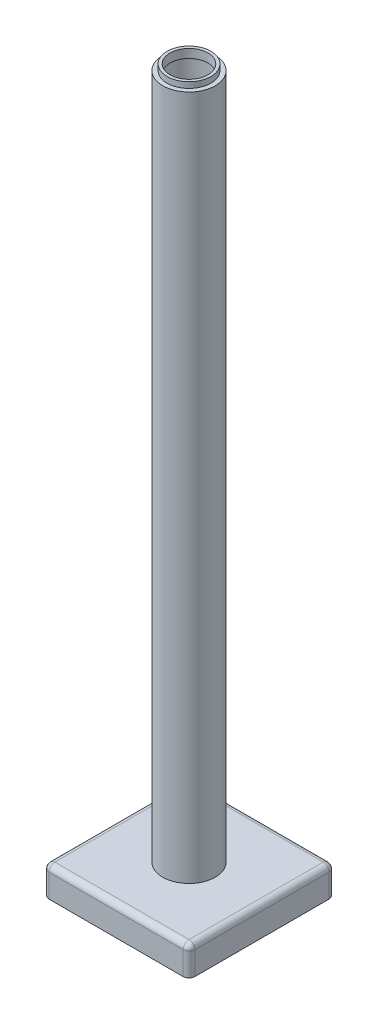
ISO-10303-21;
HEADER;
FILE_DESCRIPTION(('STEP AP214'),'2;1');
FILE_NAME('part.step','',(''),(''),'','','');
FILE_SCHEMA(('AUTOMOTIVE_DESIGN { 1 0 10303 214 1 1 1 1 }'));
ENDSEC;
DATA;
#1=APPLICATION_CONTEXT('core data for automotive mechanical design processes');
#2=APPLICATION_PROTOCOL_DEFINITION('international standard','automotive_design',2000,#1);
#3=PRODUCT_CONTEXT('',#1,'mechanical');
#4=PRODUCT('Part','Part','',(#3));
#5=PRODUCT_RELATED_PRODUCT_CATEGORY('part','',(#4));
#6=PRODUCT_DEFINITION_FORMATION('','',#4);
#7=PRODUCT_DEFINITION_CONTEXT('part definition',#1,'design');
#8=PRODUCT_DEFINITION('design','',#6,#7);
#9=PRODUCT_DEFINITION_SHAPE('','',#8);
#10=(LENGTH_UNIT() NAMED_UNIT(*) SI_UNIT(.MILLI.,.METRE.));
#11=(NAMED_UNIT(*) PLANE_ANGLE_UNIT() SI_UNIT($,.RADIAN.));
#12=(NAMED_UNIT(*) SI_UNIT($,.STERADIAN.) SOLID_ANGLE_UNIT());
#13=UNCERTAINTY_MEASURE_WITH_UNIT(LENGTH_MEASURE(1.E-05),#10,'distance_accuracy_value','');
#14=(GEOMETRIC_REPRESENTATION_CONTEXT(3) GLOBAL_UNCERTAINTY_ASSIGNED_CONTEXT((#13)) GLOBAL_UNIT_ASSIGNED_CONTEXT((#10,
#11,#12)) REPRESENTATION_CONTEXT('',''));
#15=CARTESIAN_POINT('',(0.,0.,0.));
#16=DIRECTION('',(0.,0.,1.));
#17=DIRECTION('',(1.,0.,0.));
#18=AXIS2_PLACEMENT_3D('',#15,#16,#17);
#19=CARTESIAN_POINT('',(0.,245.,0.));
#20=DIRECTION('',(0.,-1.,0.));
#21=DIRECTION('',(0.,0.,-1.));
#22=AXIS2_PLACEMENT_3D('',#19,#20,#21);
#23=CYLINDRICAL_SURFACE('',#22,7.5);
#24=CARTESIAN_POINT('',(0.,10.,0.));
#25=DIRECTION('',(0.,1.,0.));
#26=DIRECTION('',(0.,0.,1.));
#27=AXIS2_PLACEMENT_3D('',#24,#25,#26);
#28=CIRCLE('',#27,7.5);
#29=CARTESIAN_POINT('',(0.,9.99999999999998,-7.5));
#30=VERTEX_POINT('',#29);
#31=EDGE_CURVE('E61',#30,#30,#28,.T.);
#32=CARTESIAN_POINT('',(0.,244.,0.));
#33=DIRECTION('',(0.,1.,0.));
#34=DIRECTION('',(0.,0.,1.));
#35=AXIS2_PLACEMENT_3D('',#32,#33,#34);
#36=CIRCLE('',#35,7.5);
#37=CARTESIAN_POINT('',(0.,244.,-7.5));
#38=VERTEX_POINT('',#37);
#39=EDGE_CURVE('E67',#38,#38,#36,.T.);
#40=CARTESIAN_POINT('',(0.,9.99999999999998,-7.5));
#41=CARTESIAN_POINT('',(0.,12.4375,-7.5));
#42=CARTESIAN_POINT('',(0.,14.875,-7.5));
#43=CARTESIAN_POINT('',(0.,19.75,-7.5));
#44=CARTESIAN_POINT('',(0.,22.1875,-7.5));
#45=CARTESIAN_POINT('',(0.,27.0625,-7.5));
#46=CARTESIAN_POINT('',(0.,29.5,-7.5));
#47=CARTESIAN_POINT('',(0.,34.375,-7.5));
#48=CARTESIAN_POINT('',(0.,36.8125,-7.5));
#49=CARTESIAN_POINT('',(0.,41.6875,-7.5));
#50=CARTESIAN_POINT('',(0.,44.125,-7.5));
#51=CARTESIAN_POINT('',(0.,49.,-7.5));
#52=CARTESIAN_POINT('',(0.,51.4375,-7.5));
#53=CARTESIAN_POINT('',(0.,56.3125,-7.5));
#54=CARTESIAN_POINT('',(0.,58.75,-7.5));
#55=CARTESIAN_POINT('',(0.,63.625,-7.5));
#56=CARTESIAN_POINT('',(0.,66.0625,-7.5));
#57=CARTESIAN_POINT('',(0.,70.9375,-7.5));
#58=CARTESIAN_POINT('',(0.,73.375,-7.5));
#59=CARTESIAN_POINT('',(0.,78.25,-7.5));
#60=CARTESIAN_POINT('',(0.,80.6875,-7.5));
#61=CARTESIAN_POINT('',(0.,85.5625,-7.5));
#62=CARTESIAN_POINT('',(0.,88.,-7.5));
#63=CARTESIAN_POINT('',(0.,92.875,-7.5));
#64=CARTESIAN_POINT('',(0.,95.3125,-7.5));
#65=CARTESIAN_POINT('',(0.,100.1875,-7.5));
#66=CARTESIAN_POINT('',(0.,102.625,-7.5));
#67=CARTESIAN_POINT('',(0.,107.5,-7.5));
#68=CARTESIAN_POINT('',(0.,109.9375,-7.5));
#69=CARTESIAN_POINT('',(0.,114.8125,-7.5));
#70=CARTESIAN_POINT('',(0.,117.25,-7.5));
#71=CARTESIAN_POINT('',(0.,122.125,-7.5));
#72=CARTESIAN_POINT('',(0.,124.5625,-7.5));
#73=CARTESIAN_POINT('',(0.,129.4375,-7.5));
#74=CARTESIAN_POINT('',(0.,131.875,-7.5));
#75=CARTESIAN_POINT('',(0.,136.75,-7.5));
#76=CARTESIAN_POINT('',(0.,139.1875,-7.5));
#77=CARTESIAN_POINT('',(0.,144.0625,-7.5));
#78=CARTESIAN_POINT('',(0.,146.5,-7.5));
#79=CARTESIAN_POINT('',(0.,151.375,-7.5));
#80=CARTESIAN_POINT('',(0.,153.8125,-7.5));
#81=CARTESIAN_POINT('',(0.,158.6875,-7.5));
#82=CARTESIAN_POINT('',(0.,161.125,-7.5));
#83=CARTESIAN_POINT('',(0.,166.,-7.5));
#84=CARTESIAN_POINT('',(0.,168.4375,-7.5));
#85=CARTESIAN_POINT('',(0.,173.3125,-7.5));
#86=CARTESIAN_POINT('',(0.,175.75,-7.5));
#87=CARTESIAN_POINT('',(0.,180.625,-7.5));
#88=CARTESIAN_POINT('',(0.,183.0625,-7.5));
#89=CARTESIAN_POINT('',(0.,187.9375,-7.5));
#90=CARTESIAN_POINT('',(0.,190.375,-7.5));
#91=CARTESIAN_POINT('',(0.,195.25,-7.5));
#92=CARTESIAN_POINT('',(0.,197.6875,-7.5));
#93=CARTESIAN_POINT('',(0.,202.5625,-7.5));
#94=CARTESIAN_POINT('',(0.,205.,-7.5));
#95=CARTESIAN_POINT('',(0.,209.875,-7.5));
#96=CARTESIAN_POINT('',(0.,212.3125,-7.5));
#97=CARTESIAN_POINT('',(0.,217.1875,-7.5));
#98=CARTESIAN_POINT('',(0.,219.625,-7.5));
#99=CARTESIAN_POINT('',(0.,224.5,-7.5));
#100=CARTESIAN_POINT('',(0.,226.9375,-7.5));
#101=CARTESIAN_POINT('',(0.,231.8125,-7.5));
#102=CARTESIAN_POINT('',(0.,234.25,-7.5));
#103=CARTESIAN_POINT('',(0.,239.125,-7.5));
#104=CARTESIAN_POINT('',(0.,241.5625,-7.5));
#105=CARTESIAN_POINT('',(0.,244.,-7.5));
#106=B_SPLINE_CURVE_WITH_KNOTS('',3,(#40,#41,#42,#43,#44,#45,#46,#47,#48,#49,#50,#51,#52,#53,
#54,#55,#56,#57,#58,#59,#60,#61,#62,#63,#64,#65,#66,#67,#68,#69,#70,#71,#72,#73,#74,#75,#76,#77,
#78,#79,#80,#81,#82,#83,#84,#85,#86,#87,#88,#89,#90,#91,#92,#93,#94,#95,#96,#97,#98,#99,#100,
#101,#102,#103,#104,#105),.UNSPECIFIED.,.F.,.F.,(4,2,2,2,2,2,2,2,2,2,2,2,2,2,2,2,2,2,2,2,2,2,2,
2,2,2,2,2,2,2,2,2,4),(0.,7.3125,14.625,21.9375,29.25,36.5625,43.875,51.1875,58.5,65.8125,73.125,
80.4375,87.75,95.0625,102.375,109.6875,117.,124.3125,131.625,138.9375,146.25,153.5625,160.875,
168.1875,175.5,182.8125,190.125,197.4375,204.75,212.0625,219.375,226.6875,234.),.UNSPECIFIED.);
#107=EDGE_CURVE('BSEAM48',#30,#38,#106,.T.);
#108=ORIENTED_EDGE('',*,*,#31,.F.);
#109=ORIENTED_EDGE('',*,*,#39,.T.);
#110=ORIENTED_EDGE('',*,*,#107,.T.);
#111=ORIENTED_EDGE('',*,*,#107,.F.);
#112=EDGE_LOOP('',(#108,#110,#109,#111));
#113=FACE_BOUND('',#112,.T.);
#114=ADVANCED_FACE('F48',(#113),#23,.F.);
#115=CARTESIAN_POINT('',(0.,245.,0.));
#116=DIRECTION('',(0.,-1.,0.));
#117=DIRECTION('',(0.,0.,-1.));
#118=AXIS2_PLACEMENT_3D('',#115,#116,#117);
#119=CYLINDRICAL_SURFACE('',#118,9.);
#120=CARTESIAN_POINT('',(0.,245.,0.));
#121=DIRECTION('',(0.,1.,0.));
#122=DIRECTION('',(0.,0.,1.));
#123=AXIS2_PLACEMENT_3D('',#120,#121,#122);
#124=CIRCLE('',#123,9.);
#125=CARTESIAN_POINT('',(0.,245.,-9.));
#126=VERTEX_POINT('',#125);
#127=EDGE_CURVE('E11',#126,#126,#124,.T.);
#128=CARTESIAN_POINT('',(0.,10.,0.));
#129=DIRECTION('',(0.,1.,0.));
#130=DIRECTION('',(0.,0.,1.));
#131=AXIS2_PLACEMENT_3D('',#128,#129,#130);
#132=CIRCLE('',#131,9.);
#133=CARTESIAN_POINT('',(0.,9.99999999999998,-9.));
#134=VERTEX_POINT('',#133);
#135=EDGE_CURVE('E52',#134,#134,#132,.T.);
#136=CARTESIAN_POINT('',(0.,245.,-9.));
#137=CARTESIAN_POINT('',(0.,242.552083333333,-9.));
#138=CARTESIAN_POINT('',(0.,240.104166666667,-9.));
#139=CARTESIAN_POINT('',(0.,235.208333333333,-9.));
#140=CARTESIAN_POINT('',(0.,232.760416666667,-9.));
#141=CARTESIAN_POINT('',(0.,227.864583333333,-9.));
#142=CARTESIAN_POINT('',(0.,225.416666666667,-9.));
#143=CARTESIAN_POINT('',(0.,220.520833333333,-9.));
#144=CARTESIAN_POINT('',(0.,218.072916666667,-9.));
#145=CARTESIAN_POINT('',(0.,213.177083333333,-9.));
#146=CARTESIAN_POINT('',(0.,210.729166666667,-9.));
#147=CARTESIAN_POINT('',(0.,205.833333333333,-9.));
#148=CARTESIAN_POINT('',(0.,203.385416666667,-9.));
#149=CARTESIAN_POINT('',(0.,198.489583333333,-9.));
#150=CARTESIAN_POINT('',(0.,196.041666666667,-9.));
#151=CARTESIAN_POINT('',(0.,191.145833333333,-9.));
#152=CARTESIAN_POINT('',(0.,188.697916666667,-9.));
#153=CARTESIAN_POINT('',(0.,183.802083333333,-9.));
#154=CARTESIAN_POINT('',(0.,181.354166666667,-9.));
#155=CARTESIAN_POINT('',(0.,176.458333333333,-9.));
#156=CARTESIAN_POINT('',(0.,174.010416666667,-9.));
#157=CARTESIAN_POINT('',(0.,169.114583333333,-9.));
#158=CARTESIAN_POINT('',(0.,166.666666666667,-9.));
#159=CARTESIAN_POINT('',(0.,161.770833333333,-9.));
#160=CARTESIAN_POINT('',(0.,159.322916666667,-9.));
#161=CARTESIAN_POINT('',(0.,154.427083333333,-9.));
#162=CARTESIAN_POINT('',(0.,151.979166666667,-9.));
#163=CARTESIAN_POINT('',(0.,147.083333333333,-9.));
#164=CARTESIAN_POINT('',(0.,144.635416666667,-9.));
#165=CARTESIAN_POINT('',(0.,139.739583333333,-9.));
#166=CARTESIAN_POINT('',(0.,137.291666666667,-9.));
#167=CARTESIAN_POINT('',(0.,132.395833333333,-9.));
#168=CARTESIAN_POINT('',(0.,129.947916666667,-9.));
#169=CARTESIAN_POINT('',(0.,125.052083333333,-9.));
#170=CARTESIAN_POINT('',(0.,122.604166666667,-9.));
#171=CARTESIAN_POINT('',(0.,117.708333333333,-9.));
#172=CARTESIAN_POINT('',(0.,115.260416666667,-9.));
#173=CARTESIAN_POINT('',(0.,110.364583333333,-9.));
#174=CARTESIAN_POINT('',(0.,107.916666666667,-9.));
#175=CARTESIAN_POINT('',(0.,103.020833333333,-9.));
#176=CARTESIAN_POINT('',(0.,100.572916666667,-9.));
#177=CARTESIAN_POINT('',(0.,95.6770833333333,-9.));
#178=CARTESIAN_POINT('',(0.,93.2291666666667,-9.));
#179=CARTESIAN_POINT('',(0.,88.3333333333333,-9.));
#180=CARTESIAN_POINT('',(0.,85.8854166666667,-9.));
#181=CARTESIAN_POINT('',(0.,80.9895833333333,-9.));
#182=CARTESIAN_POINT('',(0.,78.5416666666667,-9.));
#183=CARTESIAN_POINT('',(0.,73.6458333333333,-9.));
#184=CARTESIAN_POINT('',(0.,71.1979166666667,-9.));
#185=CARTESIAN_POINT('',(0.,66.3020833333333,-9.));
#186=CARTESIAN_POINT('',(0.,63.8541666666667,-9.));
#187=CARTESIAN_POINT('',(0.,58.9583333333333,-9.));
#188=CARTESIAN_POINT('',(0.,56.5104166666667,-9.));
#189=CARTESIAN_POINT('',(0.,51.6145833333333,-9.));
#190=CARTESIAN_POINT('',(0.,49.1666666666666,-9.));
#191=CARTESIAN_POINT('',(0.,44.2708333333333,-9.));
#192=CARTESIAN_POINT('',(0.,41.8229166666667,-9.));
#193=CARTESIAN_POINT('',(0.,36.9270833333333,-9.));
#194=CARTESIAN_POINT('',(0.,34.4791666666667,-9.));
#195=CARTESIAN_POINT('',(0.,29.5833333333333,-9.));
#196=CARTESIAN_POINT('',(0.,27.1354166666666,-9.));
#197=CARTESIAN_POINT('',(0.,22.2395833333333,-9.));
#198=CARTESIAN_POINT('',(0.,19.7916666666667,-9.));
#199=CARTESIAN_POINT('',(0.,14.8958333333333,-9.));
#200=CARTESIAN_POINT('',(0.,12.4479166666666,-9.));
#201=CARTESIAN_POINT('',(0.,9.99999999999998,-9.));
#202=B_SPLINE_CURVE_WITH_KNOTS('',3,(#136,#137,#138,#139,#140,#141,#142,#143,#144,#145,#146,
#147,#148,#149,#150,#151,#152,#153,#154,#155,#156,#157,#158,#159,#160,#161,#162,#163,#164,#165,
#166,#167,#168,#169,#170,#171,#172,#173,#174,#175,#176,#177,#178,#179,#180,#181,#182,#183,#184,
#185,#186,#187,#188,#189,#190,#191,#192,#193,#194,#195,#196,#197,#198,#199,#200,#201),
.UNSPECIFIED.,.F.,.F.,(4,2,2,2,2,2,2,2,2,2,2,2,2,2,2,2,2,2,2,2,2,2,2,2,2,2,2,2,2,2,2,2,4),(0.,
7.34374999999998,14.6875,22.03125,29.375,36.71875,44.0625,51.40625,58.75,66.09375,73.4375,
80.78125,88.125,95.46875,102.8125,110.15625,117.5,124.84375,132.1875,139.53125,146.875,
154.21875,161.5625,168.90625,176.25,183.59375,190.9375,198.28125,205.625,212.96875,220.3125,
227.65625,235.),.UNSPECIFIED.);
#203=EDGE_CURVE('BSEAM50',#126,#134,#202,.T.);
#204=ORIENTED_EDGE('',*,*,#127,.F.);
#205=ORIENTED_EDGE('',*,*,#135,.T.);
#206=ORIENTED_EDGE('',*,*,#203,.T.);
#207=ORIENTED_EDGE('',*,*,#203,.F.);
#208=EDGE_LOOP('',(#204,#206,#205,#207));
#209=FACE_BOUND('',#208,.T.);
#210=ADVANCED_FACE('F50',(#209),#119,.T.);
#211=CARTESIAN_POINT('',(0.,245.,0.));
#212=DIRECTION('',(0.,1.,0.));
#213=DIRECTION('',(0.,0.,1.));
#214=AXIS2_PLACEMENT_3D('',#211,#212,#213);
#215=PLANE('',#214);
#216=CARTESIAN_POINT('',(0.,245.,0.));
#217=DIRECTION('',(0.,1.,0.));
#218=DIRECTION('',(0.,0.,1.));
#219=AXIS2_PLACEMENT_3D('',#216,#217,#218);
#220=CIRCLE('',#219,7.5);
#221=CARTESIAN_POINT('',(0.,245.,7.5));
#222=VERTEX_POINT('',#221);
#223=EDGE_CURVE('E59',#222,#222,#220,.T.);
#224=ORIENTED_EDGE('',*,*,#223,.F.);
#225=EDGE_LOOP('',(#224));
#226=FACE_BOUND('',#225,.T.);
#227=ORIENTED_EDGE('',*,*,#127,.T.);
#228=EDGE_LOOP('',(#227));
#229=FACE_BOUND('',#228,.T.);
#230=ADVANCED_FACE('F109',(#226,#229),#215,.T.);
#231=CARTESIAN_POINT('',(0.,10.,0.));
#232=DIRECTION('',(0.,1.,0.));
#233=DIRECTION('',(0.,0.,1.));
#234=AXIS2_PLACEMENT_3D('',#231,#232,#233);
#235=PLANE('',#234);
#236=ORIENTED_EDGE('',*,*,#31,.T.);
#237=EDGE_LOOP('',(#236));
#238=FACE_BOUND('',#237,.T.);
#239=ORIENTED_EDGE('',*,*,#135,.F.);
#240=EDGE_LOOP('',(#239));
#241=FACE_BOUND('',#240,.T.);
#242=ADVANCED_FACE('F101',(#238,#241),#235,.F.);
#243=CARTESIAN_POINT('',(0.,244.,0.));
#244=DIRECTION('',(0.,1.,0.));
#245=DIRECTION('',(0.,0.,1.));
#246=AXIS2_PLACEMENT_3D('',#243,#244,#245);
#247=PLANE('',#246);
#248=CARTESIAN_POINT('',(0.,244.,0.));
#249=DIRECTION('',(0.,1.,0.));
#250=DIRECTION('',(0.,0.,1.));
#251=AXIS2_PLACEMENT_3D('',#248,#249,#250);
#252=CIRCLE('',#251,6.5);
#253=CARTESIAN_POINT('',(0.,244.,6.5));
#254=VERTEX_POINT('',#253);
#255=EDGE_CURVE('E70',#254,#254,#252,.T.);
#256=ORIENTED_EDGE('',*,*,#255,.T.);
#257=EDGE_LOOP('',(#256));
#258=FACE_BOUND('',#257,.T.);
#259=ORIENTED_EDGE('',*,*,#39,.F.);
#260=EDGE_LOOP('',(#259));
#261=FACE_BOUND('',#260,.T.);
#262=ADVANCED_FACE('F79',(#258,#261),#247,.F.);
#263=CARTESIAN_POINT('',(0.,247.,0.));
#264=DIRECTION('',(0.,-1.,0.));
#265=DIRECTION('',(0.,0.,-1.));
#266=AXIS2_PLACEMENT_3D('',#263,#264,#265);
#267=CYLINDRICAL_SURFACE('',#266,7.5);
#268=ORIENTED_EDGE('',*,*,#223,.T.);
#269=EDGE_LOOP('',(#268));
#270=FACE_BOUND('',#269,.T.);
#271=CARTESIAN_POINT('',(0.,247.,0.));
#272=DIRECTION('',(0.,1.,0.));
#273=DIRECTION('',(0.,0.,1.));
#274=AXIS2_PLACEMENT_3D('',#271,#272,#273);
#275=CIRCLE('',#274,7.5);
#276=CARTESIAN_POINT('',(0.,247.,7.5));
#277=VERTEX_POINT('',#276);
#278=EDGE_CURVE('E64',#277,#277,#275,.T.);
#279=ORIENTED_EDGE('',*,*,#278,.F.);
#280=EDGE_LOOP('',(#279));
#281=FACE_BOUND('',#280,.T.);
#282=ADVANCED_FACE('F91',(#270,#281),#267,.T.);
#283=CARTESIAN_POINT('',(0.,247.,0.));
#284=DIRECTION('',(0.,1.,0.));
#285=DIRECTION('',(0.,0.,1.));
#286=AXIS2_PLACEMENT_3D('',#283,#284,#285);
#287=PLANE('',#286);
#288=CARTESIAN_POINT('',(0.,247.,0.));
#289=DIRECTION('',(0.,1.,0.));
#290=DIRECTION('',(0.,0.,1.));
#291=AXIS2_PLACEMENT_3D('',#288,#289,#290);
#292=CIRCLE('',#291,6.5);
#293=CARTESIAN_POINT('',(0.,247.,6.5));
#294=VERTEX_POINT('',#293);
#295=EDGE_CURVE('E73',#294,#294,#292,.T.);
#296=ORIENTED_EDGE('',*,*,#295,.F.);
#297=EDGE_LOOP('',(#296));
#298=FACE_BOUND('',#297,.T.);
#299=ORIENTED_EDGE('',*,*,#278,.T.);
#300=EDGE_LOOP('',(#299));
#301=FACE_BOUND('',#300,.T.);
#302=ADVANCED_FACE('F85',(#298,#301),#287,.T.);
#303=CARTESIAN_POINT('',(0.,247.,0.));
#304=DIRECTION('',(0.,-1.,0.));
#305=DIRECTION('',(0.,0.,-1.));
#306=AXIS2_PLACEMENT_3D('',#303,#304,#305);
#307=CYLINDRICAL_SURFACE('',#306,6.5);
#308=ORIENTED_EDGE('',*,*,#255,.F.);
#309=EDGE_LOOP('',(#308));
#310=FACE_BOUND('',#309,.T.);
#311=ORIENTED_EDGE('',*,*,#295,.T.);
#312=EDGE_LOOP('',(#311));
#313=FACE_BOUND('',#312,.T.);
#314=ADVANCED_FACE('F82',(#310,#313),#307,.F.);
#315=CLOSED_SHELL('',(#114,#210,#230,#242,#262,#282,#302,#314));
#316=MANIFOLD_SOLID_BREP('B2',#315);
#317=CARTESIAN_POINT('',(0.,10.,0.));
#318=DIRECTION('',(0.,-1.,0.));
#319=DIRECTION('',(0.,0.,-1.));
#320=AXIS2_PLACEMENT_3D('',#317,#318,#319);
#321=PLANE('',#320);
#322=DIRECTION('',(-1.,0.,0.));
#323=VECTOR('',#322,1.);
#324=CARTESIAN_POINT('',(0.,10.,-23.));
#325=LINE('',#324,#323);
#326=CARTESIAN_POINT('',(23.,10.,-23.));
#327=VERTEX_POINT('',#326);
#328=CARTESIAN_POINT('',(-23.,10.,-23.));
#329=VERTEX_POINT('',#328);
#330=EDGE_CURVE('E311',#327,#329,#325,.T.);
#331=ORIENTED_EDGE('',*,*,#330,.T.);
#332=DIRECTION('',(0.,0.,1.));
#333=VECTOR('',#332,1.);
#334=CARTESIAN_POINT('',(-23.,10.,0.));
#335=LINE('',#334,#333);
#336=CARTESIAN_POINT('',(-23.,10.,23.));
#337=VERTEX_POINT('',#336);
#338=EDGE_CURVE('E317',#329,#337,#335,.T.);
#339=ORIENTED_EDGE('',*,*,#338,.T.);
#340=DIRECTION('',(1.,0.,0.));
#341=VECTOR('',#340,1.);
#342=CARTESIAN_POINT('',(0.,10.,23.));
#343=LINE('',#342,#341);
#344=CARTESIAN_POINT('',(23.,10.,23.));
#345=VERTEX_POINT('',#344);
#346=EDGE_CURVE('E315',#337,#345,#343,.T.);
#347=ORIENTED_EDGE('',*,*,#346,.T.);
#348=DIRECTION('',(0.,0.,-1.));
#349=VECTOR('',#348,1.);
#350=CARTESIAN_POINT('',(23.,10.,0.));
#351=LINE('',#350,#349);
#352=EDGE_CURVE('E313',#345,#327,#351,.T.);
#353=ORIENTED_EDGE('',*,*,#352,.T.);
#354=EDGE_LOOP('',(#331,#339,#347,#353));
#355=FACE_BOUND('',#354,.T.);
#356=CARTESIAN_POINT('',(0.,10.,0.));
#357=DIRECTION('',(0.,1.,0.));
#358=DIRECTION('',(0.,0.,1.));
#359=AXIS2_PLACEMENT_3D('',#356,#357,#358);
#360=CIRCLE('',#359,7.5);
#361=CARTESIAN_POINT('',(0.,10.,7.5));
#362=VERTEX_POINT('',#361);
#363=EDGE_CURVE('E361',#362,#362,#360,.T.);
#364=ORIENTED_EDGE('',*,*,#363,.F.);
#365=EDGE_LOOP('',(#364));
#366=FACE_BOUND('',#365,.T.);
#367=ADVANCED_FACE('F185',(#355,#366),#321,.F.);
#368=CARTESIAN_POINT('',(0.,0.,0.));
#369=DIRECTION('',(0.,-1.,0.));
#370=DIRECTION('',(0.,0.,-1.));
#371=AXIS2_PLACEMENT_3D('',#368,#369,#370);
#372=PLANE('',#371);
#373=DIRECTION('',(1.,0.,0.));
#374=VECTOR('',#373,1.);
#375=CARTESIAN_POINT('',(-25.,0.,25.));
#376=LINE('',#375,#374);
#377=CARTESIAN_POINT('',(-23.,0.,25.));
#378=VERTEX_POINT('',#377);
#379=CARTESIAN_POINT('',(23.,0.,25.));
#380=VERTEX_POINT('',#379);
#381=EDGE_CURVE('E277',#378,#380,#376,.T.);
#382=ORIENTED_EDGE('',*,*,#381,.F.);
#383=CARTESIAN_POINT('',(-23.,0.,23.));
#384=DIRECTION('',(0.,-1.,0.));
#385=DIRECTION('',(0.,0.,-1.));
#386=AXIS2_PLACEMENT_3D('',#383,#384,#385);
#387=CIRCLE('',#386,2.);
#388=CARTESIAN_POINT('',(-25.,0.,23.));
#389=VERTEX_POINT('',#388);
#390=EDGE_CURVE('E261',#378,#389,#387,.T.);
#391=ORIENTED_EDGE('',*,*,#390,.T.);
#392=DIRECTION('',(0.,0.,1.));
#393=VECTOR('',#392,1.);
#394=CARTESIAN_POINT('',(-25.,0.,25.));
#395=LINE('',#394,#393);
#396=CARTESIAN_POINT('',(-25.,0.,-23.));
#397=VERTEX_POINT('',#396);
#398=EDGE_CURVE('E289',#397,#389,#395,.T.);
#399=ORIENTED_EDGE('',*,*,#398,.F.);
#400=CARTESIAN_POINT('',(-23.,0.,-23.));
#401=DIRECTION('',(0.,-1.,0.));
#402=DIRECTION('',(0.,0.,-1.));
#403=AXIS2_PLACEMENT_3D('',#400,#401,#402);
#404=CIRCLE('',#403,2.);
#405=CARTESIAN_POINT('',(-23.,0.,-25.));
#406=VERTEX_POINT('',#405);
#407=EDGE_CURVE('E272',#397,#406,#404,.T.);
#408=ORIENTED_EDGE('',*,*,#407,.T.);
#409=DIRECTION('',(-1.,0.,0.));
#410=VECTOR('',#409,1.);
#411=CARTESIAN_POINT('',(-25.,0.,-25.));
#412=LINE('',#411,#410);
#413=CARTESIAN_POINT('',(23.,0.,-25.));
#414=VERTEX_POINT('',#413);
#415=EDGE_CURVE('E292',#414,#406,#412,.T.);
#416=ORIENTED_EDGE('',*,*,#415,.F.);
#417=CARTESIAN_POINT('',(23.,0.,-23.));
#418=DIRECTION('',(0.,-1.,0.));
#419=DIRECTION('',(0.,0.,-1.));
#420=AXIS2_PLACEMENT_3D('',#417,#418,#419);
#421=CIRCLE('',#420,2.);
#422=CARTESIAN_POINT('',(25.,0.,-23.));
#423=VERTEX_POINT('',#422);
#424=EDGE_CURVE('E298',#414,#423,#421,.T.);
#425=ORIENTED_EDGE('',*,*,#424,.T.);
#426=DIRECTION('',(0.,0.,-1.));
#427=VECTOR('',#426,1.);
#428=CARTESIAN_POINT('',(25.,0.,25.));
#429=LINE('',#428,#427);
#430=CARTESIAN_POINT('',(25.,0.,23.));
#431=VERTEX_POINT('',#430);
#432=EDGE_CURVE('E365',#431,#423,#429,.T.);
#433=ORIENTED_EDGE('',*,*,#432,.F.);
#434=CARTESIAN_POINT('',(23.,0.,23.));
#435=DIRECTION('',(0.,-1.,0.));
#436=DIRECTION('',(0.,0.,-1.));
#437=AXIS2_PLACEMENT_3D('',#434,#435,#436);
#438=CIRCLE('',#437,2.);
#439=EDGE_CURVE('E282',#431,#380,#438,.T.);
#440=ORIENTED_EDGE('',*,*,#439,.T.);
#441=EDGE_LOOP('',(#382,#391,#399,#408,#416,#425,#433,#440));
#442=FACE_BOUND('',#441,.T.);
#443=CARTESIAN_POINT('',(0.,0.,0.));
#444=DIRECTION('',(0.,1.,0.));
#445=DIRECTION('',(0.,0.,1.));
#446=AXIS2_PLACEMENT_3D('',#443,#444,#445);
#447=CIRCLE('',#446,7.5);
#448=CARTESIAN_POINT('',(0.,0.,7.5));
#449=VERTEX_POINT('',#448);
#450=EDGE_CURVE('E357',#449,#449,#447,.T.);
#451=ORIENTED_EDGE('',*,*,#450,.T.);
#452=EDGE_LOOP('',(#451));
#453=FACE_BOUND('',#452,.T.);
#454=ADVANCED_FACE('F284',(#442,#453),#372,.T.);
#455=CARTESIAN_POINT('',(25.,10.,25.));
#456=DIRECTION('',(-1.,0.,0.));
#457=DIRECTION('',(0.,0.,1.));
#458=AXIS2_PLACEMENT_3D('',#455,#456,#457);
#459=PLANE('',#458);
#460=ORIENTED_EDGE('',*,*,#432,.T.);
#461=DIRECTION('',(0.,-1.,0.));
#462=VECTOR('',#461,1.);
#463=CARTESIAN_POINT('',(25.,10.,-23.));
#464=LINE('',#463,#462);
#465=CARTESIAN_POINT('',(25.,8.,-23.));
#466=VERTEX_POINT('',#465);
#467=EDGE_CURVE('E46',#423,#466,#464,.F.);
#468=ORIENTED_EDGE('',*,*,#467,.T.);
#469=DIRECTION('',(0.,0.,-1.));
#470=VECTOR('',#469,1.);
#471=CARTESIAN_POINT('',(25.,8.,25.));
#472=LINE('',#471,#470);
#473=CARTESIAN_POINT('',(25.,8.,23.));
#474=VERTEX_POINT('',#473);
#475=EDGE_CURVE('E194',#466,#474,#472,.F.);
#476=ORIENTED_EDGE('',*,*,#475,.T.);
#477=DIRECTION('',(0.,-1.,0.));
#478=VECTOR('',#477,1.);
#479=CARTESIAN_POINT('',(25.,10.,23.));
#480=LINE('',#479,#478);
#481=EDGE_CURVE('E320',#474,#431,#480,.T.);
#482=ORIENTED_EDGE('',*,*,#481,.T.);
#483=EDGE_LOOP('',(#460,#468,#476,#482));
#484=FACE_BOUND('',#483,.T.);
#485=ADVANCED_FACE('F387',(#484),#459,.F.);
#486=CARTESIAN_POINT('',(-25.,10.,-25.));
#487=DIRECTION('',(0.,0.,1.));
#488=DIRECTION('',(1.,0.,0.));
#489=AXIS2_PLACEMENT_3D('',#486,#487,#488);
#490=PLANE('',#489);
#491=ORIENTED_EDGE('',*,*,#415,.T.);
#492=DIRECTION('',(0.,-1.,0.));
#493=VECTOR('',#492,1.);
#494=CARTESIAN_POINT('',(-23.,10.,-25.));
#495=LINE('',#494,#493);
#496=CARTESIAN_POINT('',(-23.,8.,-25.));
#497=VERTEX_POINT('',#496);
#498=EDGE_CURVE('E309',#406,#497,#495,.F.);
#499=ORIENTED_EDGE('',*,*,#498,.T.);
#500=DIRECTION('',(-1.,0.,0.));
#501=VECTOR('',#500,1.);
#502=CARTESIAN_POINT('',(-25.,8.,-25.));
#503=LINE('',#502,#501);
#504=CARTESIAN_POINT('',(23.,8.,-25.));
#505=VERTEX_POINT('',#504);
#506=EDGE_CURVE('E307',#497,#505,#503,.F.);
#507=ORIENTED_EDGE('',*,*,#506,.T.);
#508=DIRECTION('',(0.,-1.,0.));
#509=VECTOR('',#508,1.);
#510=CARTESIAN_POINT('',(23.,10.,-25.));
#511=LINE('',#510,#509);
#512=EDGE_CURVE('E305',#505,#414,#511,.T.);
#513=ORIENTED_EDGE('',*,*,#512,.T.);
#514=EDGE_LOOP('',(#491,#499,#507,#513));
#515=FACE_BOUND('',#514,.T.);
#516=ADVANCED_FACE('F372',(#515),#490,.F.);
#517=CARTESIAN_POINT('',(-25.,10.,25.));
#518=DIRECTION('',(1.,0.,0.));
#519=DIRECTION('',(0.,0.,-1.));
#520=AXIS2_PLACEMENT_3D('',#517,#518,#519);
#521=PLANE('',#520);
#522=ORIENTED_EDGE('',*,*,#398,.T.);
#523=DIRECTION('',(0.,-1.,0.));
#524=VECTOR('',#523,1.);
#525=CARTESIAN_POINT('',(-25.,10.,23.));
#526=LINE('',#525,#524);
#527=CARTESIAN_POINT('',(-25.,8.,23.));
#528=VERTEX_POINT('',#527);
#529=EDGE_CURVE('E266',#389,#528,#526,.F.);
#530=ORIENTED_EDGE('',*,*,#529,.T.);
#531=DIRECTION('',(0.,0.,1.));
#532=VECTOR('',#531,1.);
#533=CARTESIAN_POINT('',(-25.,8.,25.));
#534=LINE('',#533,#532);
#535=CARTESIAN_POINT('',(-25.,8.,-23.));
#536=VERTEX_POINT('',#535);
#537=EDGE_CURVE('E271',#528,#536,#534,.F.);
#538=ORIENTED_EDGE('',*,*,#537,.T.);
#539=DIRECTION('',(0.,-1.,0.));
#540=VECTOR('',#539,1.);
#541=CARTESIAN_POINT('',(-25.,10.,-23.));
#542=LINE('',#541,#540);
#543=EDGE_CURVE('E302',#536,#397,#542,.T.);
#544=ORIENTED_EDGE('',*,*,#543,.T.);
#545=EDGE_LOOP('',(#522,#530,#538,#544));
#546=FACE_BOUND('',#545,.T.);
#547=ADVANCED_FACE('F409',(#546),#521,.F.);
#548=CARTESIAN_POINT('',(-25.,10.,25.));
#549=DIRECTION('',(0.,0.,-1.));
#550=DIRECTION('',(-1.,0.,0.));
#551=AXIS2_PLACEMENT_3D('',#548,#549,#550);
#552=PLANE('',#551);
#553=DIRECTION('',(1.,0.,0.));
#554=VECTOR('',#553,1.);
#555=CARTESIAN_POINT('',(-25.,8.,25.));
#556=LINE('',#555,#554);
#557=CARTESIAN_POINT('',(23.,8.,25.));
#558=VERTEX_POINT('',#557);
#559=CARTESIAN_POINT('',(-23.,8.,25.));
#560=VERTEX_POINT('',#559);
#561=EDGE_CURVE('E280',#558,#560,#556,.F.);
#562=ORIENTED_EDGE('',*,*,#561,.T.);
#563=DIRECTION('',(0.,-1.,0.));
#564=VECTOR('',#563,1.);
#565=CARTESIAN_POINT('',(-23.,10.,25.));
#566=LINE('',#565,#564);
#567=EDGE_CURVE('E265',#560,#378,#566,.T.);
#568=ORIENTED_EDGE('',*,*,#567,.T.);
#569=ORIENTED_EDGE('',*,*,#381,.T.);
#570=DIRECTION('',(0.,-1.,0.));
#571=VECTOR('',#570,1.);
#572=CARTESIAN_POINT('',(23.,10.,25.));
#573=LINE('',#572,#571);
#574=EDGE_CURVE('E288',#380,#558,#573,.F.);
#575=ORIENTED_EDGE('',*,*,#574,.T.);
#576=EDGE_LOOP('',(#562,#568,#569,#575));
#577=FACE_BOUND('',#576,.T.);
#578=ADVANCED_FACE('F276',(#577),#552,.F.);
#579=CARTESIAN_POINT('',(0.,10.,0.));
#580=DIRECTION('',(0.,-1.,0.));
#581=DIRECTION('',(0.,0.,-1.));
#582=AXIS2_PLACEMENT_3D('',#579,#580,#581);
#583=CYLINDRICAL_SURFACE('',#582,7.5);
#584=ORIENTED_EDGE('',*,*,#363,.T.);
#585=EDGE_LOOP('',(#584));
#586=FACE_BOUND('',#585,.T.);
#587=ORIENTED_EDGE('',*,*,#450,.F.);
#588=EDGE_LOOP('',(#587));
#589=FACE_BOUND('',#588,.T.);
#590=ADVANCED_FACE('F416',(#586,#589),#583,.F.);
#591=CARTESIAN_POINT('',(23.,10.,-23.));
#592=DIRECTION('',(0.,-1.,0.));
#593=DIRECTION('',(0.,0.,-1.));
#594=AXIS2_PLACEMENT_3D('',#591,#592,#593);
#595=CYLINDRICAL_SURFACE('',#594,2.);
#596=CARTESIAN_POINT('',(23.,8.,-23.));
#597=DIRECTION('',(0.,1.,0.));
#598=DIRECTION('',(0.,0.,1.));
#599=AXIS2_PLACEMENT_3D('',#596,#597,#598);
#600=CIRCLE('',#599,2.);
#601=EDGE_CURVE('E189',#466,#505,#600,.T.);
#602=ORIENTED_EDGE('',*,*,#601,.F.);
#603=ORIENTED_EDGE('',*,*,#467,.F.);
#604=ORIENTED_EDGE('',*,*,#424,.F.);
#605=ORIENTED_EDGE('',*,*,#512,.F.);
#606=EDGE_LOOP('',(#602,#603,#604,#605));
#607=FACE_BOUND('',#606,.T.);
#608=ADVANCED_FACE('F187',(#607),#595,.T.);
#609=CARTESIAN_POINT('',(23.,8.,-23.));
#610=DIRECTION('',(0.,0.,-1.));
#611=DIRECTION('',(-1.,0.,0.));
#612=AXIS2_PLACEMENT_3D('',#609,#610,#611);
#613=SPHERICAL_SURFACE('',#612,2.);
#614=CARTESIAN_POINT('',(23.,8.,-23.));
#615=DIRECTION('',(0.,0.,-1.));
#616=DIRECTION('',(-1.,0.,0.));
#617=AXIS2_PLACEMENT_3D('',#614,#615,#616);
#618=CIRCLE('',#617,2.);
#619=EDGE_CURVE('E348',#466,#327,#618,.F.);
#620=ORIENTED_EDGE('',*,*,#619,.F.);
#621=ORIENTED_EDGE('',*,*,#601,.T.);
#622=CARTESIAN_POINT('',(23.,8.,-23.));
#623=DIRECTION('',(1.,0.,0.));
#624=DIRECTION('',(0.,1.,0.));
#625=AXIS2_PLACEMENT_3D('',#622,#623,#624);
#626=CIRCLE('',#625,2.);
#627=EDGE_CURVE('E350',#327,#505,#626,.F.);
#628=ORIENTED_EDGE('',*,*,#627,.F.);
#629=EDGE_LOOP('',(#620,#621,#628));
#630=FACE_BOUND('',#629,.T.);
#631=ADVANCED_FACE('F433',(#630),#613,.T.);
#632=CARTESIAN_POINT('',(-23.,10.,-23.));
#633=DIRECTION('',(0.,-1.,0.));
#634=DIRECTION('',(0.,0.,-1.));
#635=AXIS2_PLACEMENT_3D('',#632,#633,#634);
#636=CYLINDRICAL_SURFACE('',#635,2.);
#637=ORIENTED_EDGE('',*,*,#407,.F.);
#638=ORIENTED_EDGE('',*,*,#543,.F.);
#639=CARTESIAN_POINT('',(-23.,8.,-23.));
#640=DIRECTION('',(0.,1.,0.));
#641=DIRECTION('',(0.,0.,1.));
#642=AXIS2_PLACEMENT_3D('',#639,#640,#641);
#643=CIRCLE('',#642,2.);
#644=EDGE_CURVE('E345',#497,#536,#643,.T.);
#645=ORIENTED_EDGE('',*,*,#644,.F.);
#646=ORIENTED_EDGE('',*,*,#498,.F.);
#647=EDGE_LOOP('',(#637,#638,#645,#646));
#648=FACE_BOUND('',#647,.T.);
#649=ADVANCED_FACE('F378',(#648),#636,.T.);
#650=CARTESIAN_POINT('',(0.,8.,-23.));
#651=DIRECTION('',(-1.,0.,0.));
#652=DIRECTION('',(0.,0.,1.));
#653=AXIS2_PLACEMENT_3D('',#650,#651,#652);
#654=CYLINDRICAL_SURFACE('',#653,2.);
#655=ORIENTED_EDGE('',*,*,#627,.T.);
#656=ORIENTED_EDGE('',*,*,#506,.F.);
#657=CARTESIAN_POINT('',(-23.,8.,-23.));
#658=DIRECTION('',(-1.,0.,0.));
#659=DIRECTION('',(0.,0.,1.));
#660=AXIS2_PLACEMENT_3D('',#657,#658,#659);
#661=CIRCLE('',#660,2.);
#662=EDGE_CURVE('E342',#329,#497,#661,.T.);
#663=ORIENTED_EDGE('',*,*,#662,.F.);
#664=ORIENTED_EDGE('',*,*,#330,.F.);
#665=EDGE_LOOP('',(#655,#656,#663,#664));
#666=FACE_BOUND('',#665,.T.);
#667=ADVANCED_FACE('F385',(#666),#654,.T.);
#668=CARTESIAN_POINT('',(23.,8.,0.));
#669=DIRECTION('',(0.,0.,-1.));
#670=DIRECTION('',(-1.,0.,0.));
#671=AXIS2_PLACEMENT_3D('',#668,#669,#670);
#672=CYLINDRICAL_SURFACE('',#671,2.);
#673=ORIENTED_EDGE('',*,*,#619,.T.);
#674=ORIENTED_EDGE('',*,*,#352,.F.);
#675=CARTESIAN_POINT('',(23.,8.,23.));
#676=DIRECTION('',(0.,0.,1.));
#677=DIRECTION('',(1.,0.,0.));
#678=AXIS2_PLACEMENT_3D('',#675,#676,#677);
#679=CIRCLE('',#678,2.);
#680=EDGE_CURVE('E339',#474,#345,#679,.T.);
#681=ORIENTED_EDGE('',*,*,#680,.F.);
#682=ORIENTED_EDGE('',*,*,#475,.F.);
#683=EDGE_LOOP('',(#673,#674,#681,#682));
#684=FACE_BOUND('',#683,.T.);
#685=ADVANCED_FACE('F395',(#684),#672,.T.);
#686=CARTESIAN_POINT('',(23.,10.,23.));
#687=DIRECTION('',(0.,-1.,0.));
#688=DIRECTION('',(0.,0.,-1.));
#689=AXIS2_PLACEMENT_3D('',#686,#687,#688);
#690=CYLINDRICAL_SURFACE('',#689,2.);
#691=ORIENTED_EDGE('',*,*,#439,.F.);
#692=ORIENTED_EDGE('',*,*,#481,.F.);
#693=CARTESIAN_POINT('',(23.,8.,23.));
#694=DIRECTION('',(0.,1.,0.));
#695=DIRECTION('',(0.,0.,1.));
#696=AXIS2_PLACEMENT_3D('',#693,#694,#695);
#697=CIRCLE('',#696,2.);
#698=EDGE_CURVE('E336',#558,#474,#697,.T.);
#699=ORIENTED_EDGE('',*,*,#698,.F.);
#700=ORIENTED_EDGE('',*,*,#574,.F.);
#701=EDGE_LOOP('',(#691,#692,#699,#700));
#702=FACE_BOUND('',#701,.T.);
#703=ADVANCED_FACE('F391',(#702),#690,.T.);
#704=CARTESIAN_POINT('',(-23.,8.,-23.));
#705=DIRECTION('',(0.,0.,-1.));
#706=DIRECTION('',(-1.,0.,0.));
#707=AXIS2_PLACEMENT_3D('',#704,#705,#706);
#708=SPHERICAL_SURFACE('',#707,2.);
#709=ORIENTED_EDGE('',*,*,#662,.T.);
#710=ORIENTED_EDGE('',*,*,#644,.T.);
#711=CARTESIAN_POINT('',(-23.,8.,-23.));
#712=DIRECTION('',(0.,0.,-1.));
#713=DIRECTION('',(-1.,0.,0.));
#714=AXIS2_PLACEMENT_3D('',#711,#712,#713);
#715=CIRCLE('',#714,2.);
#716=EDGE_CURVE('E333',#329,#536,#715,.F.);
#717=ORIENTED_EDGE('',*,*,#716,.F.);
#718=EDGE_LOOP('',(#709,#710,#717));
#719=FACE_BOUND('',#718,.T.);
#720=ADVANCED_FACE('F383',(#719),#708,.T.);
#721=CARTESIAN_POINT('',(23.,8.,23.));
#722=DIRECTION('',(1.,0.,0.));
#723=DIRECTION('',(0.,0.,-1.));
#724=AXIS2_PLACEMENT_3D('',#721,#722,#723);
#725=SPHERICAL_SURFACE('',#724,2.);
#726=ORIENTED_EDGE('',*,*,#698,.T.);
#727=ORIENTED_EDGE('',*,*,#680,.T.);
#728=CARTESIAN_POINT('',(23.,8.,23.));
#729=DIRECTION('',(1.,0.,0.));
#730=DIRECTION('',(0.,0.,-1.));
#731=AXIS2_PLACEMENT_3D('',#728,#729,#730);
#732=CIRCLE('',#731,2.);
#733=EDGE_CURVE('E330',#558,#345,#732,.F.);
#734=ORIENTED_EDGE('',*,*,#733,.F.);
#735=EDGE_LOOP('',(#726,#727,#734));
#736=FACE_BOUND('',#735,.T.);
#737=ADVANCED_FACE('F397',(#736),#725,.T.);
#738=CARTESIAN_POINT('',(-23.,8.,0.));
#739=DIRECTION('',(0.,0.,1.));
#740=DIRECTION('',(1.,0.,0.));
#741=AXIS2_PLACEMENT_3D('',#738,#739,#740);
#742=CYLINDRICAL_SURFACE('',#741,2.);
#743=ORIENTED_EDGE('',*,*,#716,.T.);
#744=ORIENTED_EDGE('',*,*,#537,.F.);
#745=CARTESIAN_POINT('',(-23.,8.,23.));
#746=DIRECTION('',(0.,0.,1.));
#747=DIRECTION('',(1.,0.,0.));
#748=AXIS2_PLACEMENT_3D('',#745,#746,#747);
#749=CIRCLE('',#748,2.);
#750=EDGE_CURVE('E327',#337,#528,#749,.T.);
#751=ORIENTED_EDGE('',*,*,#750,.F.);
#752=ORIENTED_EDGE('',*,*,#338,.F.);
#753=EDGE_LOOP('',(#743,#744,#751,#752));
#754=FACE_BOUND('',#753,.T.);
#755=ADVANCED_FACE('F407',(#754),#742,.T.);
#756=CARTESIAN_POINT('',(0.,8.,23.));
#757=DIRECTION('',(1.,0.,0.));
#758=DIRECTION('',(0.,0.,-1.));
#759=AXIS2_PLACEMENT_3D('',#756,#757,#758);
#760=CYLINDRICAL_SURFACE('',#759,2.);
#761=ORIENTED_EDGE('',*,*,#733,.T.);
#762=ORIENTED_EDGE('',*,*,#346,.F.);
#763=CARTESIAN_POINT('',(-23.,8.,23.));
#764=DIRECTION('',(-1.,0.,0.));
#765=DIRECTION('',(0.,0.,1.));
#766=AXIS2_PLACEMENT_3D('',#763,#764,#765);
#767=CIRCLE('',#766,2.);
#768=EDGE_CURVE('E325',#560,#337,#767,.T.);
#769=ORIENTED_EDGE('',*,*,#768,.F.);
#770=ORIENTED_EDGE('',*,*,#561,.F.);
#771=EDGE_LOOP('',(#761,#762,#769,#770));
#772=FACE_BOUND('',#771,.T.);
#773=ADVANCED_FACE('F400',(#772),#760,.T.);
#774=CARTESIAN_POINT('',(-23.,8.,23.));
#775=DIRECTION('',(0.,1.,0.));
#776=DIRECTION('',(0.,0.,1.));
#777=AXIS2_PLACEMENT_3D('',#774,#775,#776);
#778=SPHERICAL_SURFACE('',#777,2.);
#779=ORIENTED_EDGE('',*,*,#768,.T.);
#780=ORIENTED_EDGE('',*,*,#750,.T.);
#781=CARTESIAN_POINT('',(-23.,8.,23.));
#782=DIRECTION('',(0.,1.,0.));
#783=DIRECTION('',(0.,0.,1.));
#784=AXIS2_PLACEMENT_3D('',#781,#782,#783);
#785=CIRCLE('',#784,2.);
#786=EDGE_CURVE('E323',#560,#528,#785,.F.);
#787=ORIENTED_EDGE('',*,*,#786,.F.);
#788=EDGE_LOOP('',(#779,#780,#787));
#789=FACE_BOUND('',#788,.T.);
#790=ADVANCED_FACE('F404',(#789),#778,.T.);
#791=CARTESIAN_POINT('',(-23.,10.,23.));
#792=DIRECTION('',(0.,-1.,0.));
#793=DIRECTION('',(0.,0.,-1.));
#794=AXIS2_PLACEMENT_3D('',#791,#792,#793);
#795=CYLINDRICAL_SURFACE('',#794,2.);
#796=ORIENTED_EDGE('',*,*,#786,.T.);
#797=ORIENTED_EDGE('',*,*,#529,.F.);
#798=ORIENTED_EDGE('',*,*,#390,.F.);
#799=ORIENTED_EDGE('',*,*,#567,.F.);
#800=EDGE_LOOP('',(#796,#797,#798,#799));
#801=FACE_BOUND('',#800,.T.);
#802=ADVANCED_FACE('F264',(#801),#795,.T.);
#803=CLOSED_SHELL('',(#367,#454,#485,#516,#547,#578,#590,#608,#631,#649,#667,#685,#703,#720,
#737,#755,#773,#790,#802));
#804=MANIFOLD_SOLID_BREP('B6',#803);
#805=ADVANCED_BREP_SHAPE_REPRESENTATION('',(#18,#316,#804),#14);
#806=SHAPE_DEFINITION_REPRESENTATION(#9,#805);
ENDSEC;
END-ISO-10303-21;
